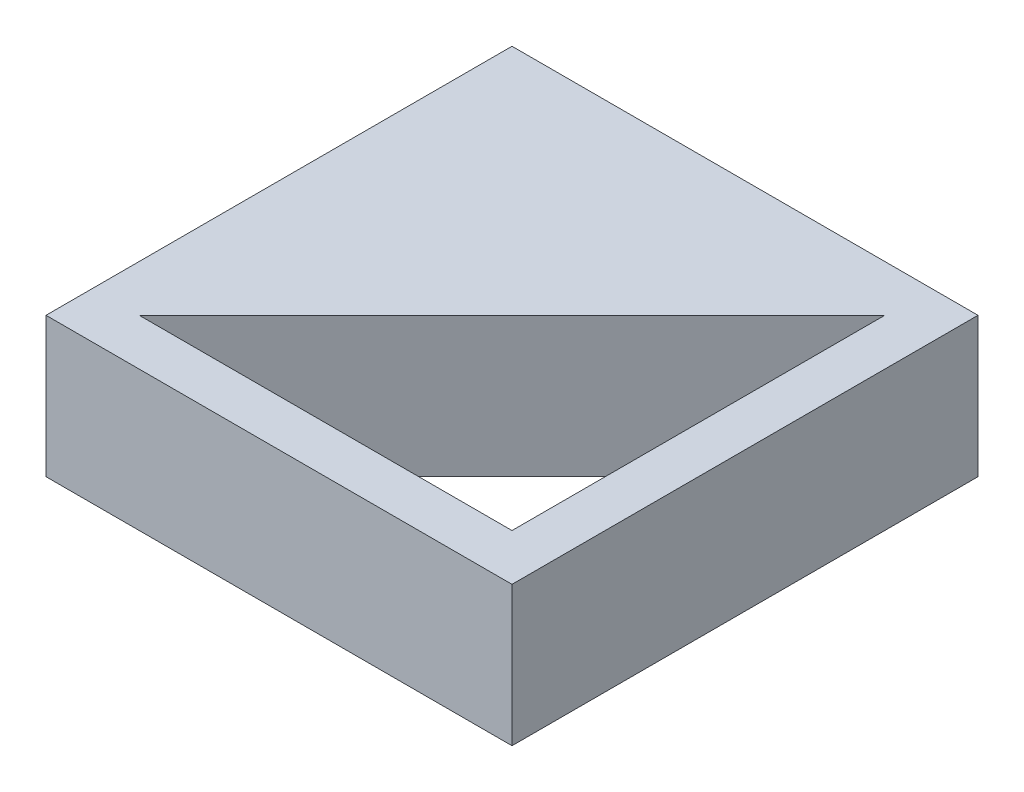
ISO-10303-21;
HEADER;
FILE_DESCRIPTION(('STEP AP214'),'2;1');
FILE_NAME('part.step','',(''),(''),'','','');
FILE_SCHEMA(('AUTOMOTIVE_DESIGN { 1 0 10303 214 1 1 1 1 }'));
ENDSEC;
DATA;
#1=APPLICATION_CONTEXT('core data for automotive mechanical design processes');
#2=APPLICATION_PROTOCOL_DEFINITION('international standard','automotive_design',2000,#1);
#3=PRODUCT_CONTEXT('',#1,'mechanical');
#4=PRODUCT('Part','Part','',(#3));
#5=PRODUCT_RELATED_PRODUCT_CATEGORY('part','',(#4));
#6=PRODUCT_DEFINITION_FORMATION('','',#4);
#7=PRODUCT_DEFINITION_CONTEXT('part definition',#1,'design');
#8=PRODUCT_DEFINITION('design','',#6,#7);
#9=PRODUCT_DEFINITION_SHAPE('','',#8);
#10=(LENGTH_UNIT() NAMED_UNIT(*) SI_UNIT(.MILLI.,.METRE.));
#11=(NAMED_UNIT(*) PLANE_ANGLE_UNIT() SI_UNIT($,.RADIAN.));
#12=(NAMED_UNIT(*) SI_UNIT($,.STERADIAN.) SOLID_ANGLE_UNIT());
#13=UNCERTAINTY_MEASURE_WITH_UNIT(LENGTH_MEASURE(1.E-05),#10,'distance_accuracy_value','');
#14=(GEOMETRIC_REPRESENTATION_CONTEXT(3) GLOBAL_UNCERTAINTY_ASSIGNED_CONTEXT((#13)) GLOBAL_UNIT_ASSIGNED_CONTEXT((#10,
#11,#12)) REPRESENTATION_CONTEXT('',''));
#15=CARTESIAN_POINT('',(0.,0.,0.));
#16=DIRECTION('',(0.,0.,1.));
#17=DIRECTION('',(1.,0.,0.));
#18=AXIS2_PLACEMENT_3D('',#15,#16,#17);
#19=CARTESIAN_POINT('',(-50.,30.,-50.));
#20=DIRECTION('',(1.,0.,0.));
#21=DIRECTION('',(0.,0.,-1.));
#22=AXIS2_PLACEMENT_3D('',#19,#20,#21);
#23=PLANE('',#22);
#24=DIRECTION('',(0.,0.,1.));
#25=VECTOR('',#24,1.);
#26=CARTESIAN_POINT('',(-50.,0.,-50.));
#27=LINE('',#26,#25);
#28=CARTESIAN_POINT('',(-50.,0.,-50.));
#29=VERTEX_POINT('',#28);
#30=CARTESIAN_POINT('',(-50.,0.,50.));
#31=VERTEX_POINT('',#30);
#32=EDGE_CURVE('E117',#29,#31,#27,.T.);
#33=ORIENTED_EDGE('',*,*,#32,.T.);
#34=DIRECTION('',(0.,-1.,0.));
#35=VECTOR('',#34,1.);
#36=CARTESIAN_POINT('',(-50.,30.,50.));
#37=LINE('',#36,#35);
#38=CARTESIAN_POINT('',(-50.,30.,50.));
#39=VERTEX_POINT('',#38);
#40=EDGE_CURVE('E11',#39,#31,#37,.T.);
#41=ORIENTED_EDGE('',*,*,#40,.F.);
#42=DIRECTION('',(0.,0.,1.));
#43=VECTOR('',#42,1.);
#44=CARTESIAN_POINT('',(-50.,30.,-50.));
#45=LINE('',#44,#43);
#46=CARTESIAN_POINT('',(-50.,30.,-50.));
#47=VERTEX_POINT('',#46);
#48=EDGE_CURVE('E119',#47,#39,#45,.T.);
#49=ORIENTED_EDGE('',*,*,#48,.F.);
#50=DIRECTION('',(0.,-1.,0.));
#51=VECTOR('',#50,1.);
#52=CARTESIAN_POINT('',(-50.,30.,-50.));
#53=LINE('',#52,#51);
#54=EDGE_CURVE('E129',#47,#29,#53,.T.);
#55=ORIENTED_EDGE('',*,*,#54,.T.);
#56=EDGE_LOOP('',(#33,#41,#49,#55));
#57=FACE_BOUND('',#56,.T.);
#58=ADVANCED_FACE('F33',(#57),#23,.F.);
#59=CARTESIAN_POINT('',(50.,30.,50.));
#60=DIRECTION('',(0.,0.,-1.));
#61=DIRECTION('',(-1.,0.,0.));
#62=AXIS2_PLACEMENT_3D('',#59,#60,#61);
#63=PLANE('',#62);
#64=DIRECTION('',(1.,0.,0.));
#65=VECTOR('',#64,1.);
#66=CARTESIAN_POINT('',(50.,0.,50.));
#67=LINE('',#66,#65);
#68=CARTESIAN_POINT('',(50.,0.,50.));
#69=VERTEX_POINT('',#68);
#70=EDGE_CURVE('E132',#31,#69,#67,.T.);
#71=ORIENTED_EDGE('',*,*,#70,.T.);
#72=DIRECTION('',(0.,-1.,0.));
#73=VECTOR('',#72,1.);
#74=CARTESIAN_POINT('',(50.,30.,50.));
#75=LINE('',#74,#73);
#76=CARTESIAN_POINT('',(50.,30.,50.));
#77=VERTEX_POINT('',#76);
#78=EDGE_CURVE('E40',#77,#69,#75,.T.);
#79=ORIENTED_EDGE('',*,*,#78,.F.);
#80=DIRECTION('',(1.,0.,0.));
#81=VECTOR('',#80,1.);
#82=CARTESIAN_POINT('',(50.,30.,50.));
#83=LINE('',#82,#81);
#84=EDGE_CURVE('E122',#39,#77,#83,.T.);
#85=ORIENTED_EDGE('',*,*,#84,.F.);
#86=ORIENTED_EDGE('',*,*,#40,.T.);
#87=EDGE_LOOP('',(#71,#79,#85,#86));
#88=FACE_BOUND('',#87,.T.);
#89=ADVANCED_FACE('F160',(#88),#63,.F.);
#90=CARTESIAN_POINT('',(50.,30.,-50.));
#91=DIRECTION('',(-1.,0.,0.));
#92=DIRECTION('',(0.,0.,1.));
#93=AXIS2_PLACEMENT_3D('',#90,#91,#92);
#94=PLANE('',#93);
#95=DIRECTION('',(0.,0.,-1.));
#96=VECTOR('',#95,1.);
#97=CARTESIAN_POINT('',(50.,0.,-50.));
#98=LINE('',#97,#96);
#99=CARTESIAN_POINT('',(50.,0.,-50.));
#100=VERTEX_POINT('',#99);
#101=EDGE_CURVE('E134',#69,#100,#98,.T.);
#102=ORIENTED_EDGE('',*,*,#101,.T.);
#103=DIRECTION('',(0.,-1.,0.));
#104=VECTOR('',#103,1.);
#105=CARTESIAN_POINT('',(50.,30.,-50.));
#106=LINE('',#105,#104);
#107=CARTESIAN_POINT('',(50.,30.,-50.));
#108=VERTEX_POINT('',#107);
#109=EDGE_CURVE('E139',#108,#100,#106,.T.);
#110=ORIENTED_EDGE('',*,*,#109,.F.);
#111=DIRECTION('',(0.,0.,-1.));
#112=VECTOR('',#111,1.);
#113=CARTESIAN_POINT('',(50.,30.,-50.));
#114=LINE('',#113,#112);
#115=EDGE_CURVE('E125',#77,#108,#114,.T.);
#116=ORIENTED_EDGE('',*,*,#115,.F.);
#117=ORIENTED_EDGE('',*,*,#78,.T.);
#118=EDGE_LOOP('',(#102,#110,#116,#117));
#119=FACE_BOUND('',#118,.T.);
#120=ADVANCED_FACE('F146',(#119),#94,.F.);
#121=CARTESIAN_POINT('',(50.,30.,-50.));
#122=DIRECTION('',(0.,0.,1.));
#123=DIRECTION('',(1.,0.,0.));
#124=AXIS2_PLACEMENT_3D('',#121,#122,#123);
#125=PLANE('',#124);
#126=DIRECTION('',(-1.,0.,0.));
#127=VECTOR('',#126,1.);
#128=CARTESIAN_POINT('',(50.,0.,-50.));
#129=LINE('',#128,#127);
#130=EDGE_CURVE('E123',#100,#29,#129,.T.);
#131=ORIENTED_EDGE('',*,*,#130,.T.);
#132=ORIENTED_EDGE('',*,*,#54,.F.);
#133=DIRECTION('',(-1.,0.,0.));
#134=VECTOR('',#133,1.);
#135=CARTESIAN_POINT('',(50.,30.,-50.));
#136=LINE('',#135,#134);
#137=EDGE_CURVE('E127',#108,#47,#136,.T.);
#138=ORIENTED_EDGE('',*,*,#137,.F.);
#139=ORIENTED_EDGE('',*,*,#109,.T.);
#140=EDGE_LOOP('',(#131,#132,#138,#139));
#141=FACE_BOUND('',#140,.T.);
#142=ADVANCED_FACE('F153',(#141),#125,.F.);
#143=CARTESIAN_POINT('',(0.,30.,0.));
#144=DIRECTION('',(0.,-1.,0.));
#145=DIRECTION('',(0.,0.,-1.));
#146=AXIS2_PLACEMENT_3D('',#143,#144,#145);
#147=PLANE('',#146);
#148=DIRECTION('',(1.,0.,0.));
#149=VECTOR('',#148,1.);
#150=CARTESIAN_POINT('',(40.,30.,40.));
#151=LINE('',#150,#149);
#152=CARTESIAN_POINT('',(-40.,30.,40.));
#153=VERTEX_POINT('',#152);
#154=CARTESIAN_POINT('',(40.,30.,40.));
#155=VERTEX_POINT('',#154);
#156=EDGE_CURVE('E109',#153,#155,#151,.T.);
#157=ORIENTED_EDGE('',*,*,#156,.F.);
#158=DIRECTION('',(-0.707106781186548,0.,0.707106781186547));
#159=VECTOR('',#158,1.);
#160=CARTESIAN_POINT('',(-40.,30.,40.));
#161=LINE('',#160,#159);
#162=CARTESIAN_POINT('',(40.,30.,-40.));
#163=VERTEX_POINT('',#162);
#164=EDGE_CURVE('E47',#163,#153,#161,.T.);
#165=ORIENTED_EDGE('',*,*,#164,.F.);
#166=DIRECTION('',(0.,0.,-1.));
#167=VECTOR('',#166,1.);
#168=CARTESIAN_POINT('',(40.,30.,-40.));
#169=LINE('',#168,#167);
#170=EDGE_CURVE('E106',#155,#163,#169,.T.);
#171=ORIENTED_EDGE('',*,*,#170,.F.);
#172=EDGE_LOOP('',(#157,#165,#171));
#173=FACE_BOUND('',#172,.T.);
#174=ORIENTED_EDGE('',*,*,#48,.T.);
#175=ORIENTED_EDGE('',*,*,#84,.T.);
#176=ORIENTED_EDGE('',*,*,#115,.T.);
#177=ORIENTED_EDGE('',*,*,#137,.T.);
#178=EDGE_LOOP('',(#174,#175,#176,#177));
#179=FACE_BOUND('',#178,.T.);
#180=ADVANCED_FACE('F159',(#173,#179),#147,.F.);
#181=CARTESIAN_POINT('',(0.,0.,0.));
#182=DIRECTION('',(0.,-1.,0.));
#183=DIRECTION('',(0.,0.,-1.));
#184=AXIS2_PLACEMENT_3D('',#181,#182,#183);
#185=PLANE('',#184);
#186=DIRECTION('',(-0.707106781186548,0.,0.707106781186547));
#187=VECTOR('',#186,1.);
#188=CARTESIAN_POINT('',(-40.,0.,40.));
#189=LINE('',#188,#187);
#190=CARTESIAN_POINT('',(40.,0.,-40.));
#191=VERTEX_POINT('',#190);
#192=CARTESIAN_POINT('',(-40.,0.,40.));
#193=VERTEX_POINT('',#192);
#194=EDGE_CURVE('E93',#191,#193,#189,.T.);
#195=ORIENTED_EDGE('',*,*,#194,.T.);
#196=DIRECTION('',(1.,0.,0.));
#197=VECTOR('',#196,1.);
#198=CARTESIAN_POINT('',(40.,0.,40.));
#199=LINE('',#198,#197);
#200=CARTESIAN_POINT('',(40.,0.,40.));
#201=VERTEX_POINT('',#200);
#202=EDGE_CURVE('E100',#193,#201,#199,.T.);
#203=ORIENTED_EDGE('',*,*,#202,.T.);
#204=DIRECTION('',(0.,0.,-1.));
#205=VECTOR('',#204,1.);
#206=CARTESIAN_POINT('',(40.,0.,-40.));
#207=LINE('',#206,#205);
#208=EDGE_CURVE('E55',#201,#191,#207,.T.);
#209=ORIENTED_EDGE('',*,*,#208,.T.);
#210=EDGE_LOOP('',(#195,#203,#209));
#211=FACE_BOUND('',#210,.T.);
#212=ORIENTED_EDGE('',*,*,#32,.F.);
#213=ORIENTED_EDGE('',*,*,#130,.F.);
#214=ORIENTED_EDGE('',*,*,#101,.F.);
#215=ORIENTED_EDGE('',*,*,#70,.F.);
#216=EDGE_LOOP('',(#212,#213,#214,#215));
#217=FACE_BOUND('',#216,.T.);
#218=ADVANCED_FACE('F104',(#211,#217),#185,.T.);
#219=CARTESIAN_POINT('',(-40.,0.,40.));
#220=DIRECTION('',(-0.707106781186547,0.,-0.707106781186548));
#221=DIRECTION('',(-0.707106781186548,0.,0.707106781186547));
#222=AXIS2_PLACEMENT_3D('',#219,#220,#221);
#223=PLANE('',#222);
#224=ORIENTED_EDGE('',*,*,#164,.T.);
#225=DIRECTION('',(0.,1.,0.));
#226=VECTOR('',#225,1.);
#227=CARTESIAN_POINT('',(-40.,0.,40.));
#228=LINE('',#227,#226);
#229=EDGE_CURVE('E89',#193,#153,#228,.T.);
#230=ORIENTED_EDGE('',*,*,#229,.F.);
#231=ORIENTED_EDGE('',*,*,#194,.F.);
#232=DIRECTION('',(0.,1.,0.));
#233=VECTOR('',#232,1.);
#234=CARTESIAN_POINT('',(40.,0.,-40.));
#235=LINE('',#234,#233);
#236=EDGE_CURVE('E115',#191,#163,#235,.T.);
#237=ORIENTED_EDGE('',*,*,#236,.T.);
#238=EDGE_LOOP('',(#224,#230,#231,#237));
#239=FACE_BOUND('',#238,.T.);
#240=ADVANCED_FACE('F91',(#239),#223,.F.);
#241=CARTESIAN_POINT('',(40.,0.,-40.));
#242=DIRECTION('',(1.,0.,0.));
#243=DIRECTION('',(0.,0.,-1.));
#244=AXIS2_PLACEMENT_3D('',#241,#242,#243);
#245=PLANE('',#244);
#246=ORIENTED_EDGE('',*,*,#170,.T.);
#247=ORIENTED_EDGE('',*,*,#236,.F.);
#248=ORIENTED_EDGE('',*,*,#208,.F.);
#249=DIRECTION('',(0.,1.,0.));
#250=VECTOR('',#249,1.);
#251=CARTESIAN_POINT('',(40.,0.,40.));
#252=LINE('',#251,#250);
#253=EDGE_CURVE('E97',#201,#155,#252,.T.);
#254=ORIENTED_EDGE('',*,*,#253,.T.);
#255=EDGE_LOOP('',(#246,#247,#248,#254));
#256=FACE_BOUND('',#255,.T.);
#257=ADVANCED_FACE('F177',(#256),#245,.F.);
#258=CARTESIAN_POINT('',(40.,0.,40.));
#259=DIRECTION('',(0.,0.,1.));
#260=DIRECTION('',(1.,0.,0.));
#261=AXIS2_PLACEMENT_3D('',#258,#259,#260);
#262=PLANE('',#261);
#263=ORIENTED_EDGE('',*,*,#156,.T.);
#264=ORIENTED_EDGE('',*,*,#253,.F.);
#265=ORIENTED_EDGE('',*,*,#202,.F.);
#266=ORIENTED_EDGE('',*,*,#229,.T.);
#267=EDGE_LOOP('',(#263,#264,#265,#266));
#268=FACE_BOUND('',#267,.T.);
#269=ADVANCED_FACE('F101',(#268),#262,.F.);
#270=CLOSED_SHELL('',(#58,#89,#120,#142,#180,#218,#240,#257,#269));
#271=MANIFOLD_SOLID_BREP('B2',#270);
#272=ADVANCED_BREP_SHAPE_REPRESENTATION('',(#18,#271),#14);
#273=SHAPE_DEFINITION_REPRESENTATION(#9,#272);
ENDSEC;
END-ISO-10303-21;
